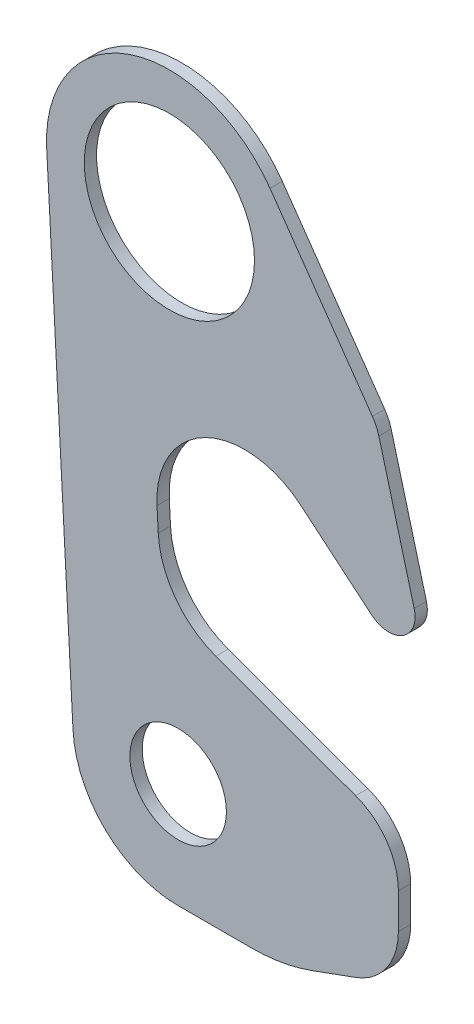
ISO-10303-21;
HEADER;
FILE_DESCRIPTION(('STEP AP214'),'2;1');
FILE_NAME('part.step','',(''),(''),'','','');
FILE_SCHEMA(('AUTOMOTIVE_DESIGN { 1 0 10303 214 1 1 1 1 }'));
ENDSEC;
DATA;
#1=APPLICATION_CONTEXT('core data for automotive mechanical design processes');
#2=APPLICATION_PROTOCOL_DEFINITION('international standard','automotive_design',2000,#1);
#3=PRODUCT_CONTEXT('',#1,'mechanical');
#4=PRODUCT('Part','Part','',(#3));
#5=PRODUCT_RELATED_PRODUCT_CATEGORY('part','',(#4));
#6=PRODUCT_DEFINITION_FORMATION('','',#4);
#7=PRODUCT_DEFINITION_CONTEXT('part definition',#1,'design');
#8=PRODUCT_DEFINITION('design','',#6,#7);
#9=PRODUCT_DEFINITION_SHAPE('','',#8);
#10=(LENGTH_UNIT() NAMED_UNIT(*) SI_UNIT(.MILLI.,.METRE.));
#11=(NAMED_UNIT(*) PLANE_ANGLE_UNIT() SI_UNIT($,.RADIAN.));
#12=(NAMED_UNIT(*) SI_UNIT($,.STERADIAN.) SOLID_ANGLE_UNIT());
#13=UNCERTAINTY_MEASURE_WITH_UNIT(LENGTH_MEASURE(1.E-05),#10,'distance_accuracy_value','');
#14=(GEOMETRIC_REPRESENTATION_CONTEXT(3) GLOBAL_UNCERTAINTY_ASSIGNED_CONTEXT((#13)) GLOBAL_UNIT_ASSIGNED_CONTEXT((#10,
#11,#12)) REPRESENTATION_CONTEXT('',''));
#15=CARTESIAN_POINT('',(0.,0.,0.));
#16=DIRECTION('',(0.,0.,1.));
#17=DIRECTION('',(1.,0.,0.));
#18=AXIS2_PLACEMENT_3D('',#15,#16,#17);
#19=CARTESIAN_POINT('',(0.,0.,7.));
#20=DIRECTION('',(0.,0.,1.));
#21=DIRECTION('',(1.,0.,0.));
#22=AXIS2_PLACEMENT_3D('',#19,#20,#21);
#23=PLANE('',#22);
#24=CARTESIAN_POINT('',(0.,0.,7.));
#25=DIRECTION('',(0.,0.,1.));
#26=DIRECTION('',(1.,0.,0.));
#27=AXIS2_PLACEMENT_3D('',#24,#25,#26);
#28=CIRCLE('',#27,48.5);
#29=CARTESIAN_POINT('',(48.5,0.,7.));
#30=VERTEX_POINT('',#29);
#31=EDGE_CURVE('E200',#30,#30,#28,.T.);
#32=ORIENTED_EDGE('',*,*,#31,.F.);
#33=EDGE_LOOP('',(#32));
#34=FACE_BOUND('',#33,.T.);
#35=CARTESIAN_POINT('',(0.,0.,7.));
#36=DIRECTION('',(0.,0.,1.));
#37=DIRECTION('',(1.,0.,0.));
#38=AXIS2_PLACEMENT_3D('',#35,#36,#37);
#39=CIRCLE('',#38,70.);
#40=CARTESIAN_POINT('',(57.3406431002294,40.1503505445733,7.));
#41=VERTEX_POINT('',#40);
#42=CARTESIAN_POINT('',(-69.899577582523,-3.74820674254508,7.));
#43=VERTEX_POINT('',#42);
#44=EDGE_CURVE('E231',#41,#43,#39,.T.);
#45=ORIENTED_EDGE('',*,*,#44,.T.);
#46=DIRECTION('',(0.0535458106077868,-0.998565394036041,0.));
#47=VECTOR('',#46,1.);
#48=CARTESIAN_POINT('',(-54.9139236421624,-283.212748636467,7.));
#49=LINE('',#48,#47);
#50=CARTESIAN_POINT('',(-54.9139236421624,-283.212748636467,7.));
#51=VERTEX_POINT('',#50);
#52=EDGE_CURVE('E129',#43,#51,#49,.T.);
#53=ORIENTED_EDGE('',*,*,#52,.T.);
#54=CARTESIAN_POINT('',(5.00000000000009,-280.,7.));
#55=DIRECTION('',(0.,0.,1.));
#56=DIRECTION('',(1.,0.,0.));
#57=AXIS2_PLACEMENT_3D('',#54,#55,#56);
#58=CIRCLE('',#57,60.);
#59=CARTESIAN_POINT('',(5.00000000000009,-340.,7.));
#60=VERTEX_POINT('',#59);
#61=EDGE_CURVE('E276',#51,#60,#58,.T.);
#62=ORIENTED_EDGE('',*,*,#61,.T.);
#63=DIRECTION('',(1.,0.,0.));
#64=VECTOR('',#63,1.);
#65=CARTESIAN_POINT('',(5.00000000000009,-340.,7.));
#66=LINE('',#65,#64);
#67=CARTESIAN_POINT('',(46.9278438622428,-340.,7.));
#68=VERTEX_POINT('',#67);
#69=EDGE_CURVE('E295',#60,#68,#66,.T.);
#70=ORIENTED_EDGE('',*,*,#69,.T.);
#71=CARTESIAN_POINT('',(46.9278438622428,-240.,7.));
#72=DIRECTION('',(0.,0.,1.));
#73=DIRECTION('',(1.,0.,0.));
#74=AXIS2_PLACEMENT_3D('',#71,#72,#73);
#75=CIRCLE('',#74,100.);
#76=CARTESIAN_POINT('',(81.1298581948103,-333.969262078591,7.));
#77=VERTEX_POINT('',#76);
#78=EDGE_CURVE('E292',#68,#77,#75,.T.);
#79=ORIENTED_EDGE('',*,*,#78,.T.);
#80=DIRECTION('',(0.939692620785907,0.342020143325672,0.));
#81=VECTOR('',#80,1.);
#82=CARTESIAN_POINT('',(81.1298581948103,-333.969262078591,7.));
#83=LINE('',#82,#81);
#84=CARTESIAN_POINT('',(106.15474530305,-324.860948055319,7.));
#85=VERTEX_POINT('',#84);
#86=EDGE_CURVE('E294',#77,#85,#83,.T.);
#87=ORIENTED_EDGE('',*,*,#86,.T.);
#88=CARTESIAN_POINT('',(93.5000000000001,-290.092321086241,7.));
#89=DIRECTION('',(0.,0.,1.));
#90=DIRECTION('',(-1.,0.,0.));
#91=AXIS2_PLACEMENT_3D('',#88,#89,#90);
#92=CIRCLE('',#91,36.9999999999999);
#93=CARTESIAN_POINT('',(130.5,-290.092321086241,7.));
#94=VERTEX_POINT('',#93);
#95=EDGE_CURVE('E297',#85,#94,#92,.T.);
#96=ORIENTED_EDGE('',*,*,#95,.T.);
#97=DIRECTION('',(0.,1.,0.));
#98=VECTOR('',#97,1.);
#99=CARTESIAN_POINT('',(130.5,-290.092321086241,7.));
#100=LINE('',#99,#98);
#101=CARTESIAN_POINT('',(130.5,-269.907678913759,7.));
#102=VERTEX_POINT('',#101);
#103=EDGE_CURVE('E303',#94,#102,#100,.T.);
#104=ORIENTED_EDGE('',*,*,#103,.T.);
#105=CARTESIAN_POINT('',(93.5000000000001,-269.907678913759,7.));
#106=DIRECTION('',(0.,0.,1.));
#107=DIRECTION('',(1.,0.,0.));
#108=AXIS2_PLACEMENT_3D('',#105,#106,#107);
#109=CIRCLE('',#108,37.);
#110=CARTESIAN_POINT('',(106.15474530305,-235.139051944681,7.));
#111=VERTEX_POINT('',#110);
#112=EDGE_CURVE('E305',#102,#111,#109,.T.);
#113=ORIENTED_EDGE('',*,*,#112,.T.);
#114=DIRECTION('',(-0.939692620785909,0.342020143325668,0.));
#115=VECTOR('',#114,1.);
#116=CARTESIAN_POINT('',(26.483684912015,-206.141157429919,7.));
#117=LINE('',#116,#115);
#118=CARTESIAN_POINT('',(26.483684912015,-206.141157429919,7.));
#119=VERTEX_POINT('',#118);
#120=EDGE_CURVE('E307',#111,#119,#117,.T.);
#121=ORIENTED_EDGE('',*,*,#120,.T.);
#122=CARTESIAN_POINT('',(43.5846920782984,-159.156526390624,7.));
#123=DIRECTION('',(0.,0.,-1.));
#124=DIRECTION('',(-1.,0.,0.));
#125=AXIS2_PLACEMENT_3D('',#122,#123,#124);
#126=CIRCLE('',#125,50.);
#127=CARTESIAN_POINT('',(-6.34357762350373,-161.833816921013,7.));
#128=VERTEX_POINT('',#127);
#129=EDGE_CURVE('E309',#119,#128,#126,.T.);
#130=ORIENTED_EDGE('',*,*,#129,.T.);
#131=DIRECTION('',(-0.053545810607787,0.998565394036041,0.));
#132=VECTOR('',#131,1.);
#133=CARTESIAN_POINT('',(-6.34357762350373,-161.833816921013,7.));
#134=LINE('',#133,#132);
#135=CARTESIAN_POINT('',(-7.0522141222003,-148.618592863011,7.));
#136=VERTEX_POINT('',#135);
#137=EDGE_CURVE('E311',#128,#136,#134,.T.);
#138=ORIENTED_EDGE('',*,*,#137,.T.);
#139=CARTESIAN_POINT('',(42.8760555796018,-145.941302332622,7.));
#140=DIRECTION('',(0.,0.,-1.));
#141=DIRECTION('',(-1.,0.,0.));
#142=AXIS2_PLACEMENT_3D('',#139,#140,#141);
#143=CIRCLE('',#142,50.);
#144=CARTESIAN_POINT('',(75.0154360639274,-107.639080176671,7.));
#145=VERTEX_POINT('',#144);
#146=EDGE_CURVE('E313',#136,#145,#143,.T.);
#147=ORIENTED_EDGE('',*,*,#146,.T.);
#148=DIRECTION('',(0.766044443119002,-0.64278760968651,0.));
#149=VECTOR('',#148,1.);
#150=CARTESIAN_POINT('',(75.0154360639274,-107.639080176671,7.));
#151=LINE('',#150,#149);
#152=CARTESIAN_POINT('',(115.358185854702,-141.490666646785,7.));
#153=VERTEX_POINT('',#152);
#154=EDGE_CURVE('E315',#145,#153,#151,.T.);
#155=ORIENTED_EDGE('',*,*,#154,.T.);
#156=CARTESIAN_POINT('',(125.,-130.,7.));
#157=DIRECTION('',(0.,0.,1.));
#158=DIRECTION('',(-1.,0.,0.));
#159=AXIS2_PLACEMENT_3D('',#156,#157,#158);
#160=CIRCLE('',#159,15.0000000000004);
#161=CARTESIAN_POINT('',(139.488887394336,-126.117714323461,7.));
#162=VERTEX_POINT('',#161);
#163=EDGE_CURVE('E178',#153,#162,#160,.T.);
#164=ORIENTED_EDGE('',*,*,#163,.T.);
#165=DIRECTION('',(-0.258819045102562,0.965925826289057,0.));
#166=VECTOR('',#165,1.);
#167=CARTESIAN_POINT('',(139.488887394336,-126.117714323461,7.));
#168=LINE('',#167,#166);
#169=CARTESIAN_POINT('',(119.384026273738,-51.0853511422877,7.));
#170=VERTEX_POINT('',#169);
#171=EDGE_CURVE('E172',#162,#170,#168,.T.);
#172=ORIENTED_EDGE('',*,*,#171,.T.);
#173=CARTESIAN_POINT('',(95.2358806165117,-57.5558272698518,7.));
#174=DIRECTION('',(0.,0.,1.));
#175=DIRECTION('',(1.,0.,0.));
#176=AXIS2_PLACEMENT_3D('',#173,#174,#175);
#177=CIRCLE('',#176,25.0000000000002);
#178=CARTESIAN_POINT('',(115.714681723737,-43.2164163610755,7.));
#179=VERTEX_POINT('',#178);
#180=EDGE_CURVE('E176',#170,#179,#177,.T.);
#181=ORIENTED_EDGE('',*,*,#180,.T.);
#182=DIRECTION('',(-0.573576436351047,0.819152044288991,0.));
#183=VECTOR('',#182,1.);
#184=CARTESIAN_POINT('',(57.3406431002294,40.1503505445733,7.));
#185=LINE('',#184,#183);
#186=EDGE_CURVE('E56',#179,#41,#185,.T.);
#187=ORIENTED_EDGE('',*,*,#186,.T.);
#188=EDGE_LOOP('',(#45,#53,#62,#70,#79,#87,#96,#104,#113,#121,#130,#138,#147,#155,#164,#172,
#181,#187));
#189=FACE_BOUND('',#188,.T.);
#190=CARTESIAN_POINT('',(5.00000000000009,-280.,7.));
#191=DIRECTION('',(0.,0.,1.));
#192=DIRECTION('',(1.,0.,0.));
#193=AXIS2_PLACEMENT_3D('',#190,#191,#192);
#194=CIRCLE('',#193,27.5);
#195=CARTESIAN_POINT('',(32.5000000000001,-280.,7.));
#196=VERTEX_POINT('',#195);
#197=EDGE_CURVE('E358',#196,#196,#194,.T.);
#198=ORIENTED_EDGE('',*,*,#197,.F.);
#199=EDGE_LOOP('',(#198));
#200=FACE_BOUND('',#199,.T.);
#201=ADVANCED_FACE('F39',(#34,#189,#200),#23,.T.);
#202=CARTESIAN_POINT('',(0.,0.,0.));
#203=DIRECTION('',(0.,0.,1.));
#204=DIRECTION('',(1.,0.,0.));
#205=AXIS2_PLACEMENT_3D('',#202,#203,#204);
#206=PLANE('',#205);
#207=CARTESIAN_POINT('',(0.,0.,0.));
#208=DIRECTION('',(0.,0.,1.));
#209=DIRECTION('',(1.,0.,0.));
#210=AXIS2_PLACEMENT_3D('',#207,#208,#209);
#211=CIRCLE('',#210,48.5);
#212=CARTESIAN_POINT('',(48.5,0.,0.));
#213=VERTEX_POINT('',#212);
#214=EDGE_CURVE('E363',#213,#213,#211,.T.);
#215=ORIENTED_EDGE('',*,*,#214,.T.);
#216=EDGE_LOOP('',(#215));
#217=FACE_BOUND('',#216,.T.);
#218=CARTESIAN_POINT('',(0.,0.,0.));
#219=DIRECTION('',(0.,0.,1.));
#220=DIRECTION('',(1.,0.,0.));
#221=AXIS2_PLACEMENT_3D('',#218,#219,#220);
#222=CIRCLE('',#221,70.);
#223=CARTESIAN_POINT('',(57.3406431002294,40.1503505445733,0.));
#224=VERTEX_POINT('',#223);
#225=CARTESIAN_POINT('',(-69.899577582523,-3.74820674254508,0.));
#226=VERTEX_POINT('',#225);
#227=EDGE_CURVE('E196',#224,#226,#222,.T.);
#228=ORIENTED_EDGE('',*,*,#227,.F.);
#229=DIRECTION('',(-0.573576436351047,0.819152044288991,0.));
#230=VECTOR('',#229,1.);
#231=CARTESIAN_POINT('',(57.3406431002294,40.1503505445733,0.));
#232=LINE('',#231,#230);
#233=CARTESIAN_POINT('',(115.714681723737,-43.2164163610755,0.));
#234=VERTEX_POINT('',#233);
#235=EDGE_CURVE('E121',#234,#224,#232,.T.);
#236=ORIENTED_EDGE('',*,*,#235,.F.);
#237=CARTESIAN_POINT('',(95.2358806165117,-57.5558272698518,0.));
#238=DIRECTION('',(0.,0.,1.));
#239=DIRECTION('',(1.,0.,0.));
#240=AXIS2_PLACEMENT_3D('',#237,#238,#239);
#241=CIRCLE('',#240,25.0000000000002);
#242=CARTESIAN_POINT('',(119.384026273738,-51.0853511422877,0.));
#243=VERTEX_POINT('',#242);
#244=EDGE_CURVE('E115',#243,#234,#241,.T.);
#245=ORIENTED_EDGE('',*,*,#244,.F.);
#246=DIRECTION('',(-0.258819045102562,0.965925826289057,0.));
#247=VECTOR('',#246,1.);
#248=CARTESIAN_POINT('',(139.488887394336,-126.117714323461,0.));
#249=LINE('',#248,#247);
#250=CARTESIAN_POINT('',(139.488887394336,-126.117714323461,0.));
#251=VERTEX_POINT('',#250);
#252=EDGE_CURVE('E186',#251,#243,#249,.T.);
#253=ORIENTED_EDGE('',*,*,#252,.F.);
#254=CARTESIAN_POINT('',(125.,-130.,0.));
#255=DIRECTION('',(0.,0.,1.));
#256=DIRECTION('',(-1.,0.,0.));
#257=AXIS2_PLACEMENT_3D('',#254,#255,#256);
#258=CIRCLE('',#257,15.0000000000004);
#259=CARTESIAN_POINT('',(115.358185854702,-141.490666646785,0.));
#260=VERTEX_POINT('',#259);
#261=EDGE_CURVE('E226',#260,#251,#258,.T.);
#262=ORIENTED_EDGE('',*,*,#261,.F.);
#263=DIRECTION('',(0.766044443119002,-0.64278760968651,0.));
#264=VECTOR('',#263,1.);
#265=CARTESIAN_POINT('',(75.0154360639274,-107.639080176671,0.));
#266=LINE('',#265,#264);
#267=CARTESIAN_POINT('',(75.0154360639274,-107.639080176671,0.));
#268=VERTEX_POINT('',#267);
#269=EDGE_CURVE('E224',#268,#260,#266,.T.);
#270=ORIENTED_EDGE('',*,*,#269,.F.);
#271=CARTESIAN_POINT('',(42.8760555796018,-145.941302332622,0.));
#272=DIRECTION('',(0.,0.,-1.));
#273=DIRECTION('',(-1.,0.,0.));
#274=AXIS2_PLACEMENT_3D('',#271,#272,#273);
#275=CIRCLE('',#274,50.);
#276=CARTESIAN_POINT('',(-7.0522141222003,-148.618592863011,0.));
#277=VERTEX_POINT('',#276);
#278=EDGE_CURVE('E222',#277,#268,#275,.T.);
#279=ORIENTED_EDGE('',*,*,#278,.F.);
#280=DIRECTION('',(-0.053545810607787,0.998565394036041,0.));
#281=VECTOR('',#280,1.);
#282=CARTESIAN_POINT('',(-6.34357762350373,-161.833816921013,0.));
#283=LINE('',#282,#281);
#284=CARTESIAN_POINT('',(-6.34357762350373,-161.833816921013,0.));
#285=VERTEX_POINT('',#284);
#286=EDGE_CURVE('E220',#285,#277,#283,.T.);
#287=ORIENTED_EDGE('',*,*,#286,.F.);
#288=CARTESIAN_POINT('',(43.5846920782984,-159.156526390624,0.));
#289=DIRECTION('',(0.,0.,-1.));
#290=DIRECTION('',(-1.,0.,0.));
#291=AXIS2_PLACEMENT_3D('',#288,#289,#290);
#292=CIRCLE('',#291,50.);
#293=CARTESIAN_POINT('',(26.483684912015,-206.141157429919,0.));
#294=VERTEX_POINT('',#293);
#295=EDGE_CURVE('E218',#294,#285,#292,.T.);
#296=ORIENTED_EDGE('',*,*,#295,.F.);
#297=DIRECTION('',(-0.939692620785909,0.342020143325668,0.));
#298=VECTOR('',#297,1.);
#299=CARTESIAN_POINT('',(26.483684912015,-206.141157429919,0.));
#300=LINE('',#299,#298);
#301=CARTESIAN_POINT('',(106.15474530305,-235.139051944681,0.));
#302=VERTEX_POINT('',#301);
#303=EDGE_CURVE('E216',#302,#294,#300,.T.);
#304=ORIENTED_EDGE('',*,*,#303,.F.);
#305=CARTESIAN_POINT('',(93.5000000000001,-269.907678913759,0.));
#306=DIRECTION('',(0.,0.,1.));
#307=DIRECTION('',(1.,0.,0.));
#308=AXIS2_PLACEMENT_3D('',#305,#306,#307);
#309=CIRCLE('',#308,37.);
#310=CARTESIAN_POINT('',(130.5,-269.907678913759,0.));
#311=VERTEX_POINT('',#310);
#312=EDGE_CURVE('E214',#311,#302,#309,.T.);
#313=ORIENTED_EDGE('',*,*,#312,.F.);
#314=DIRECTION('',(0.,1.,0.));
#315=VECTOR('',#314,1.);
#316=CARTESIAN_POINT('',(130.5,-290.092321086241,0.));
#317=LINE('',#316,#315);
#318=CARTESIAN_POINT('',(130.5,-290.092321086241,0.));
#319=VERTEX_POINT('',#318);
#320=EDGE_CURVE('E212',#319,#311,#317,.T.);
#321=ORIENTED_EDGE('',*,*,#320,.F.);
#322=CARTESIAN_POINT('',(93.5000000000001,-290.092321086241,0.));
#323=DIRECTION('',(0.,0.,1.));
#324=DIRECTION('',(-1.,0.,0.));
#325=AXIS2_PLACEMENT_3D('',#322,#323,#324);
#326=CIRCLE('',#325,36.9999999999999);
#327=CARTESIAN_POINT('',(106.15474530305,-324.860948055319,0.));
#328=VERTEX_POINT('',#327);
#329=EDGE_CURVE('E210',#328,#319,#326,.T.);
#330=ORIENTED_EDGE('',*,*,#329,.F.);
#331=DIRECTION('',(0.939692620785907,0.342020143325672,0.));
#332=VECTOR('',#331,1.);
#333=CARTESIAN_POINT('',(81.1298581948103,-333.969262078591,0.));
#334=LINE('',#333,#332);
#335=CARTESIAN_POINT('',(81.1298581948103,-333.969262078591,0.));
#336=VERTEX_POINT('',#335);
#337=EDGE_CURVE('E208',#336,#328,#334,.T.);
#338=ORIENTED_EDGE('',*,*,#337,.F.);
#339=CARTESIAN_POINT('',(46.9278438622428,-240.,0.));
#340=DIRECTION('',(0.,0.,1.));
#341=DIRECTION('',(1.,0.,0.));
#342=AXIS2_PLACEMENT_3D('',#339,#340,#341);
#343=CIRCLE('',#342,100.);
#344=CARTESIAN_POINT('',(46.9278438622428,-340.,0.));
#345=VERTEX_POINT('',#344);
#346=EDGE_CURVE('E206',#345,#336,#343,.T.);
#347=ORIENTED_EDGE('',*,*,#346,.F.);
#348=DIRECTION('',(1.,0.,0.));
#349=VECTOR('',#348,1.);
#350=CARTESIAN_POINT('',(5.00000000000009,-340.,0.));
#351=LINE('',#350,#349);
#352=CARTESIAN_POINT('',(5.00000000000009,-340.,0.));
#353=VERTEX_POINT('',#352);
#354=EDGE_CURVE('E204',#353,#345,#351,.T.);
#355=ORIENTED_EDGE('',*,*,#354,.F.);
#356=CARTESIAN_POINT('',(5.00000000000009,-280.,0.));
#357=DIRECTION('',(0.,0.,1.));
#358=DIRECTION('',(1.,0.,0.));
#359=AXIS2_PLACEMENT_3D('',#356,#357,#358);
#360=CIRCLE('',#359,60.);
#361=CARTESIAN_POINT('',(-54.9139236421624,-283.212748636467,0.));
#362=VERTEX_POINT('',#361);
#363=EDGE_CURVE('E202',#362,#353,#360,.T.);
#364=ORIENTED_EDGE('',*,*,#363,.F.);
#365=DIRECTION('',(0.0535458106077868,-0.998565394036041,0.));
#366=VECTOR('',#365,1.);
#367=CARTESIAN_POINT('',(-54.9139236421624,-283.212748636467,0.));
#368=LINE('',#367,#366);
#369=EDGE_CURVE('E199',#226,#362,#368,.T.);
#370=ORIENTED_EDGE('',*,*,#369,.F.);
#371=EDGE_LOOP('',(#228,#236,#245,#253,#262,#270,#279,#287,#296,#304,#313,#321,#330,#338,#347,
#355,#364,#370));
#372=FACE_BOUND('',#371,.T.);
#373=CARTESIAN_POINT('',(5.00000000000009,-280.,0.));
#374=DIRECTION('',(0.,0.,1.));
#375=DIRECTION('',(1.,0.,0.));
#376=AXIS2_PLACEMENT_3D('',#373,#374,#375);
#377=CIRCLE('',#376,27.5);
#378=CARTESIAN_POINT('',(32.5000000000001,-280.,0.));
#379=VERTEX_POINT('',#378);
#380=EDGE_CURVE('E361',#379,#379,#377,.T.);
#381=ORIENTED_EDGE('',*,*,#380,.T.);
#382=EDGE_LOOP('',(#381));
#383=FACE_BOUND('',#382,.T.);
#384=ADVANCED_FACE('F280',(#217,#372,#383),#206,.F.);
#385=CARTESIAN_POINT('',(0.,0.,7.));
#386=DIRECTION('',(0.,0.,-1.));
#387=DIRECTION('',(-1.,0.,0.));
#388=AXIS2_PLACEMENT_3D('',#385,#386,#387);
#389=CYLINDRICAL_SURFACE('',#388,70.);
#390=ORIENTED_EDGE('',*,*,#227,.T.);
#391=DIRECTION('',(0.,0.,-1.));
#392=VECTOR('',#391,1.);
#393=CARTESIAN_POINT('',(-69.899577582523,-3.74820674254508,7.));
#394=LINE('',#393,#392);
#395=EDGE_CURVE('E11',#43,#226,#394,.T.);
#396=ORIENTED_EDGE('',*,*,#395,.F.);
#397=ORIENTED_EDGE('',*,*,#44,.F.);
#398=DIRECTION('',(0.,0.,-1.));
#399=VECTOR('',#398,1.);
#400=CARTESIAN_POINT('',(57.3406431002294,40.1503505445733,7.));
#401=LINE('',#400,#399);
#402=EDGE_CURVE('E192',#41,#224,#401,.T.);
#403=ORIENTED_EDGE('',*,*,#402,.T.);
#404=EDGE_LOOP('',(#390,#396,#397,#403));
#405=FACE_BOUND('',#404,.T.);
#406=ADVANCED_FACE('F41',(#405),#389,.T.);
#407=CARTESIAN_POINT('',(-54.9139236421624,-283.212748636467,7.));
#408=DIRECTION('',(0.998565394036041,0.0535458106077868,0.));
#409=DIRECTION('',(-0.0535458106077869,0.998565394036042,0.));
#410=AXIS2_PLACEMENT_3D('',#407,#408,#409);
#411=PLANE('',#410);
#412=ORIENTED_EDGE('',*,*,#369,.T.);
#413=DIRECTION('',(0.,0.,-1.));
#414=VECTOR('',#413,1.);
#415=CARTESIAN_POINT('',(-54.9139236421624,-283.212748636467,7.));
#416=LINE('',#415,#414);
#417=EDGE_CURVE('E48',#51,#362,#416,.T.);
#418=ORIENTED_EDGE('',*,*,#417,.F.);
#419=ORIENTED_EDGE('',*,*,#52,.F.);
#420=ORIENTED_EDGE('',*,*,#395,.T.);
#421=EDGE_LOOP('',(#412,#418,#419,#420));
#422=FACE_BOUND('',#421,.T.);
#423=ADVANCED_FACE('F484',(#422),#411,.F.);
#424=CARTESIAN_POINT('',(5.00000000000009,-280.,7.));
#425=DIRECTION('',(0.,0.,-1.));
#426=DIRECTION('',(-1.,0.,0.));
#427=AXIS2_PLACEMENT_3D('',#424,#425,#426);
#428=CYLINDRICAL_SURFACE('',#427,60.);
#429=ORIENTED_EDGE('',*,*,#363,.T.);
#430=DIRECTION('',(0.,0.,-1.));
#431=VECTOR('',#430,1.);
#432=CARTESIAN_POINT('',(5.00000000000009,-340.,7.));
#433=LINE('',#432,#431);
#434=EDGE_CURVE('E268',#60,#353,#433,.T.);
#435=ORIENTED_EDGE('',*,*,#434,.F.);
#436=ORIENTED_EDGE('',*,*,#61,.F.);
#437=ORIENTED_EDGE('',*,*,#417,.T.);
#438=EDGE_LOOP('',(#429,#435,#436,#437));
#439=FACE_BOUND('',#438,.T.);
#440=ADVANCED_FACE('F274',(#439),#428,.T.);
#441=CARTESIAN_POINT('',(5.00000000000009,-340.,7.));
#442=DIRECTION('',(0.,1.,0.));
#443=DIRECTION('',(0.,0.,1.));
#444=AXIS2_PLACEMENT_3D('',#441,#442,#443);
#445=PLANE('',#444);
#446=ORIENTED_EDGE('',*,*,#354,.T.);
#447=DIRECTION('',(0.,0.,-1.));
#448=VECTOR('',#447,1.);
#449=CARTESIAN_POINT('',(46.9278438622428,-340.,7.));
#450=LINE('',#449,#448);
#451=EDGE_CURVE('E265',#68,#345,#450,.T.);
#452=ORIENTED_EDGE('',*,*,#451,.F.);
#453=ORIENTED_EDGE('',*,*,#69,.F.);
#454=ORIENTED_EDGE('',*,*,#434,.T.);
#455=EDGE_LOOP('',(#446,#452,#453,#454));
#456=FACE_BOUND('',#455,.T.);
#457=ADVANCED_FACE('F286',(#456),#445,.F.);
#458=CARTESIAN_POINT('',(46.9278438622428,-240.,7.));
#459=DIRECTION('',(0.,0.,-1.));
#460=DIRECTION('',(-1.,0.,0.));
#461=AXIS2_PLACEMENT_3D('',#458,#459,#460);
#462=CYLINDRICAL_SURFACE('',#461,100.);
#463=ORIENTED_EDGE('',*,*,#346,.T.);
#464=DIRECTION('',(0.,0.,-1.));
#465=VECTOR('',#464,1.);
#466=CARTESIAN_POINT('',(81.1298581948103,-333.969262078591,7.));
#467=LINE('',#466,#465);
#468=EDGE_CURVE('E262',#77,#336,#467,.T.);
#469=ORIENTED_EDGE('',*,*,#468,.F.);
#470=ORIENTED_EDGE('',*,*,#78,.F.);
#471=ORIENTED_EDGE('',*,*,#451,.T.);
#472=EDGE_LOOP('',(#463,#469,#470,#471));
#473=FACE_BOUND('',#472,.T.);
#474=ADVANCED_FACE('F290',(#473),#462,.T.);
#475=CARTESIAN_POINT('',(81.1298581948103,-333.969262078591,7.));
#476=DIRECTION('',(-0.342020143325672,0.939692620785907,0.));
#477=DIRECTION('',(-0.939692620785907,-0.342020143325672,0.));
#478=AXIS2_PLACEMENT_3D('',#475,#476,#477);
#479=PLANE('',#478);
#480=ORIENTED_EDGE('',*,*,#337,.T.);
#481=DIRECTION('',(0.,0.,-1.));
#482=VECTOR('',#481,1.);
#483=CARTESIAN_POINT('',(106.15474530305,-324.860948055319,7.));
#484=LINE('',#483,#482);
#485=EDGE_CURVE('E259',#85,#328,#484,.T.);
#486=ORIENTED_EDGE('',*,*,#485,.F.);
#487=ORIENTED_EDGE('',*,*,#86,.F.);
#488=ORIENTED_EDGE('',*,*,#468,.T.);
#489=EDGE_LOOP('',(#480,#486,#487,#488));
#490=FACE_BOUND('',#489,.T.);
#491=ADVANCED_FACE('F457',(#490),#479,.F.);
#492=CARTESIAN_POINT('',(93.5000000000001,-290.092321086241,7.));
#493=DIRECTION('',(0.,0.,-1.));
#494=DIRECTION('',(-1.,0.,0.));
#495=AXIS2_PLACEMENT_3D('',#492,#493,#494);
#496=CYLINDRICAL_SURFACE('',#495,36.9999999999999);
#497=ORIENTED_EDGE('',*,*,#329,.T.);
#498=DIRECTION('',(0.,0.,-1.));
#499=VECTOR('',#498,1.);
#500=CARTESIAN_POINT('',(130.5,-290.092321086241,7.));
#501=LINE('',#500,#499);
#502=EDGE_CURVE('E256',#94,#319,#501,.T.);
#503=ORIENTED_EDGE('',*,*,#502,.F.);
#504=ORIENTED_EDGE('',*,*,#95,.F.);
#505=ORIENTED_EDGE('',*,*,#485,.T.);
#506=EDGE_LOOP('',(#497,#503,#504,#505));
#507=FACE_BOUND('',#506,.T.);
#508=ADVANCED_FACE('F449',(#507),#496,.T.);
#509=CARTESIAN_POINT('',(130.5,-290.092321086241,7.));
#510=DIRECTION('',(-1.,0.,0.));
#511=DIRECTION('',(0.,0.,1.));
#512=AXIS2_PLACEMENT_3D('',#509,#510,#511);
#513=PLANE('',#512);
#514=ORIENTED_EDGE('',*,*,#320,.T.);
#515=DIRECTION('',(0.,0.,-1.));
#516=VECTOR('',#515,1.);
#517=CARTESIAN_POINT('',(130.5,-269.907678913759,7.));
#518=LINE('',#517,#516);
#519=EDGE_CURVE('E253',#102,#311,#518,.T.);
#520=ORIENTED_EDGE('',*,*,#519,.F.);
#521=ORIENTED_EDGE('',*,*,#103,.F.);
#522=ORIENTED_EDGE('',*,*,#502,.T.);
#523=EDGE_LOOP('',(#514,#520,#521,#522));
#524=FACE_BOUND('',#523,.T.);
#525=ADVANCED_FACE('F441',(#524),#513,.F.);
#526=CARTESIAN_POINT('',(93.5000000000001,-269.907678913759,7.));
#527=DIRECTION('',(0.,0.,-1.));
#528=DIRECTION('',(-1.,0.,0.));
#529=AXIS2_PLACEMENT_3D('',#526,#527,#528);
#530=CYLINDRICAL_SURFACE('',#529,37.);
#531=ORIENTED_EDGE('',*,*,#312,.T.);
#532=DIRECTION('',(0.,0.,-1.));
#533=VECTOR('',#532,1.);
#534=CARTESIAN_POINT('',(106.15474530305,-235.139051944681,7.));
#535=LINE('',#534,#533);
#536=EDGE_CURVE('E250',#111,#302,#535,.T.);
#537=ORIENTED_EDGE('',*,*,#536,.F.);
#538=ORIENTED_EDGE('',*,*,#112,.F.);
#539=ORIENTED_EDGE('',*,*,#519,.T.);
#540=EDGE_LOOP('',(#531,#537,#538,#539));
#541=FACE_BOUND('',#540,.T.);
#542=ADVANCED_FACE('F433',(#541),#530,.T.);
#543=CARTESIAN_POINT('',(26.483684912015,-206.141157429919,7.));
#544=DIRECTION('',(-0.342020143325668,-0.939692620785909,0.));
#545=DIRECTION('',(0.939692620785909,-0.342020143325668,0.));
#546=AXIS2_PLACEMENT_3D('',#543,#544,#545);
#547=PLANE('',#546);
#548=ORIENTED_EDGE('',*,*,#303,.T.);
#549=DIRECTION('',(0.,0.,-1.));
#550=VECTOR('',#549,1.);
#551=CARTESIAN_POINT('',(26.483684912015,-206.141157429919,7.));
#552=LINE('',#551,#550);
#553=EDGE_CURVE('E247',#119,#294,#552,.T.);
#554=ORIENTED_EDGE('',*,*,#553,.F.);
#555=ORIENTED_EDGE('',*,*,#120,.F.);
#556=ORIENTED_EDGE('',*,*,#536,.T.);
#557=EDGE_LOOP('',(#548,#554,#555,#556));
#558=FACE_BOUND('',#557,.T.);
#559=ADVANCED_FACE('F425',(#558),#547,.F.);
#560=CARTESIAN_POINT('',(43.5846920782984,-159.156526390624,7.));
#561=DIRECTION('',(0.,0.,-1.));
#562=DIRECTION('',(-1.,0.,0.));
#563=AXIS2_PLACEMENT_3D('',#560,#561,#562);
#564=CYLINDRICAL_SURFACE('',#563,50.);
#565=ORIENTED_EDGE('',*,*,#295,.T.);
#566=DIRECTION('',(0.,0.,-1.));
#567=VECTOR('',#566,1.);
#568=CARTESIAN_POINT('',(-6.34357762350373,-161.833816921013,7.));
#569=LINE('',#568,#567);
#570=EDGE_CURVE('E244',#128,#285,#569,.T.);
#571=ORIENTED_EDGE('',*,*,#570,.F.);
#572=ORIENTED_EDGE('',*,*,#129,.F.);
#573=ORIENTED_EDGE('',*,*,#553,.T.);
#574=EDGE_LOOP('',(#565,#571,#572,#573));
#575=FACE_BOUND('',#574,.T.);
#576=ADVANCED_FACE('F417',(#575),#564,.F.);
#577=CARTESIAN_POINT('',(-6.34357762350373,-161.833816921013,7.));
#578=DIRECTION('',(-0.998565394036041,-0.053545810607787,0.));
#579=DIRECTION('',(0.053545810607787,-0.998565394036042,0.));
#580=AXIS2_PLACEMENT_3D('',#577,#578,#579);
#581=PLANE('',#580);
#582=ORIENTED_EDGE('',*,*,#286,.T.);
#583=DIRECTION('',(0.,0.,-1.));
#584=VECTOR('',#583,1.);
#585=CARTESIAN_POINT('',(-7.0522141222003,-148.618592863011,7.));
#586=LINE('',#585,#584);
#587=EDGE_CURVE('E241',#136,#277,#586,.T.);
#588=ORIENTED_EDGE('',*,*,#587,.F.);
#589=ORIENTED_EDGE('',*,*,#137,.F.);
#590=ORIENTED_EDGE('',*,*,#570,.T.);
#591=EDGE_LOOP('',(#582,#588,#589,#590));
#592=FACE_BOUND('',#591,.T.);
#593=ADVANCED_FACE('F409',(#592),#581,.F.);
#594=CARTESIAN_POINT('',(42.8760555796018,-145.941302332622,7.));
#595=DIRECTION('',(0.,0.,-1.));
#596=DIRECTION('',(-1.,0.,0.));
#597=AXIS2_PLACEMENT_3D('',#594,#595,#596);
#598=CYLINDRICAL_SURFACE('',#597,50.);
#599=ORIENTED_EDGE('',*,*,#278,.T.);
#600=DIRECTION('',(0.,0.,-1.));
#601=VECTOR('',#600,1.);
#602=CARTESIAN_POINT('',(75.0154360639274,-107.639080176671,7.));
#603=LINE('',#602,#601);
#604=EDGE_CURVE('E238',#145,#268,#603,.T.);
#605=ORIENTED_EDGE('',*,*,#604,.F.);
#606=ORIENTED_EDGE('',*,*,#146,.F.);
#607=ORIENTED_EDGE('',*,*,#587,.T.);
#608=EDGE_LOOP('',(#599,#605,#606,#607));
#609=FACE_BOUND('',#608,.T.);
#610=ADVANCED_FACE('F402',(#609),#598,.F.);
#611=CARTESIAN_POINT('',(75.0154360639274,-107.639080176671,7.));
#612=DIRECTION('',(0.642787609686511,0.766044443119002,0.));
#613=DIRECTION('',(-0.766044443119002,0.642787609686511,0.));
#614=AXIS2_PLACEMENT_3D('',#611,#612,#613);
#615=PLANE('',#614);
#616=ORIENTED_EDGE('',*,*,#269,.T.);
#617=DIRECTION('',(0.,0.,-1.));
#618=VECTOR('',#617,1.);
#619=CARTESIAN_POINT('',(115.358185854702,-141.490666646785,7.));
#620=LINE('',#619,#618);
#621=EDGE_CURVE('E235',#153,#260,#620,.T.);
#622=ORIENTED_EDGE('',*,*,#621,.F.);
#623=ORIENTED_EDGE('',*,*,#154,.F.);
#624=ORIENTED_EDGE('',*,*,#604,.T.);
#625=EDGE_LOOP('',(#616,#622,#623,#624));
#626=FACE_BOUND('',#625,.T.);
#627=ADVANCED_FACE('F321',(#626),#615,.F.);
#628=CARTESIAN_POINT('',(125.,-130.,7.));
#629=DIRECTION('',(0.,0.,-1.));
#630=DIRECTION('',(-1.,0.,0.));
#631=AXIS2_PLACEMENT_3D('',#628,#629,#630);
#632=CYLINDRICAL_SURFACE('',#631,15.0000000000004);
#633=ORIENTED_EDGE('',*,*,#261,.T.);
#634=DIRECTION('',(0.,0.,-1.));
#635=VECTOR('',#634,1.);
#636=CARTESIAN_POINT('',(139.488887394336,-126.117714323461,7.));
#637=LINE('',#636,#635);
#638=EDGE_CURVE('E187',#162,#251,#637,.T.);
#639=ORIENTED_EDGE('',*,*,#638,.F.);
#640=ORIENTED_EDGE('',*,*,#163,.F.);
#641=ORIENTED_EDGE('',*,*,#621,.T.);
#642=EDGE_LOOP('',(#633,#639,#640,#641));
#643=FACE_BOUND('',#642,.T.);
#644=ADVANCED_FACE('F325',(#643),#632,.T.);
#645=CARTESIAN_POINT('',(139.488887394336,-126.117714323461,7.));
#646=DIRECTION('',(-0.965925826289057,-0.258819045102562,0.));
#647=DIRECTION('',(0.258819045102562,-0.965925826289057,0.));
#648=AXIS2_PLACEMENT_3D('',#645,#646,#647);
#649=PLANE('',#648);
#650=ORIENTED_EDGE('',*,*,#252,.T.);
#651=DIRECTION('',(0.,0.,-1.));
#652=VECTOR('',#651,1.);
#653=CARTESIAN_POINT('',(119.384026273738,-51.0853511422877,7.));
#654=LINE('',#653,#652);
#655=EDGE_CURVE('E183',#170,#243,#654,.T.);
#656=ORIENTED_EDGE('',*,*,#655,.F.);
#657=ORIENTED_EDGE('',*,*,#171,.F.);
#658=ORIENTED_EDGE('',*,*,#638,.T.);
#659=EDGE_LOOP('',(#650,#656,#657,#658));
#660=FACE_BOUND('',#659,.T.);
#661=ADVANCED_FACE('F184',(#660),#649,.F.);
#662=CARTESIAN_POINT('',(95.2358806165117,-57.5558272698518,7.));
#663=DIRECTION('',(0.,0.,-1.));
#664=DIRECTION('',(-1.,0.,0.));
#665=AXIS2_PLACEMENT_3D('',#662,#663,#664);
#666=CYLINDRICAL_SURFACE('',#665,25.0000000000002);
#667=ORIENTED_EDGE('',*,*,#244,.T.);
#668=DIRECTION('',(0.,0.,-1.));
#669=VECTOR('',#668,1.);
#670=CARTESIAN_POINT('',(115.714681723737,-43.2164163610755,7.));
#671=LINE('',#670,#669);
#672=EDGE_CURVE('E188',#179,#234,#671,.T.);
#673=ORIENTED_EDGE('',*,*,#672,.F.);
#674=ORIENTED_EDGE('',*,*,#180,.F.);
#675=ORIENTED_EDGE('',*,*,#655,.T.);
#676=EDGE_LOOP('',(#667,#673,#674,#675));
#677=FACE_BOUND('',#676,.T.);
#678=ADVANCED_FACE('F190',(#677),#666,.T.);
#679=CARTESIAN_POINT('',(57.3406431002294,40.1503505445733,7.));
#680=DIRECTION('',(-0.819152044288991,-0.573576436351047,0.));
#681=DIRECTION('',(0.573576436351047,-0.819152044288991,0.));
#682=AXIS2_PLACEMENT_3D('',#679,#680,#681);
#683=PLANE('',#682);
#684=ORIENTED_EDGE('',*,*,#235,.T.);
#685=ORIENTED_EDGE('',*,*,#402,.F.);
#686=ORIENTED_EDGE('',*,*,#186,.F.);
#687=ORIENTED_EDGE('',*,*,#672,.T.);
#688=EDGE_LOOP('',(#684,#685,#686,#687));
#689=FACE_BOUND('',#688,.T.);
#690=ADVANCED_FACE('F329',(#689),#683,.F.);
#691=CARTESIAN_POINT('',(0.,0.,7.));
#692=DIRECTION('',(0.,0.,-1.));
#693=DIRECTION('',(-1.,0.,0.));
#694=AXIS2_PLACEMENT_3D('',#691,#692,#693);
#695=CYLINDRICAL_SURFACE('',#694,48.5);
#696=ORIENTED_EDGE('',*,*,#31,.T.);
#697=EDGE_LOOP('',(#696));
#698=FACE_BOUND('',#697,.T.);
#699=ORIENTED_EDGE('',*,*,#214,.F.);
#700=EDGE_LOOP('',(#699));
#701=FACE_BOUND('',#700,.T.);
#702=ADVANCED_FACE('F331',(#698,#701),#695,.F.);
#703=CARTESIAN_POINT('',(5.00000000000009,-280.,7.));
#704=DIRECTION('',(0.,0.,-1.));
#705=DIRECTION('',(-1.,0.,0.));
#706=AXIS2_PLACEMENT_3D('',#703,#704,#705);
#707=CYLINDRICAL_SURFACE('',#706,27.5);
#708=ORIENTED_EDGE('',*,*,#197,.T.);
#709=EDGE_LOOP('',(#708));
#710=FACE_BOUND('',#709,.T.);
#711=ORIENTED_EDGE('',*,*,#380,.F.);
#712=EDGE_LOOP('',(#711));
#713=FACE_BOUND('',#712,.T.);
#714=ADVANCED_FACE('F337',(#710,#713),#707,.F.);
#715=CLOSED_SHELL('',(#201,#384,#406,#423,#440,#457,#474,#491,#508,#525,#542,#559,#576,#593,
#610,#627,#644,#661,#678,#690,#702,#714));
#716=MANIFOLD_SOLID_BREP('B2',#715);
#717=ADVANCED_BREP_SHAPE_REPRESENTATION('',(#18,#716),#14);
#718=SHAPE_DEFINITION_REPRESENTATION(#9,#717);
ENDSEC;
END-ISO-10303-21;
